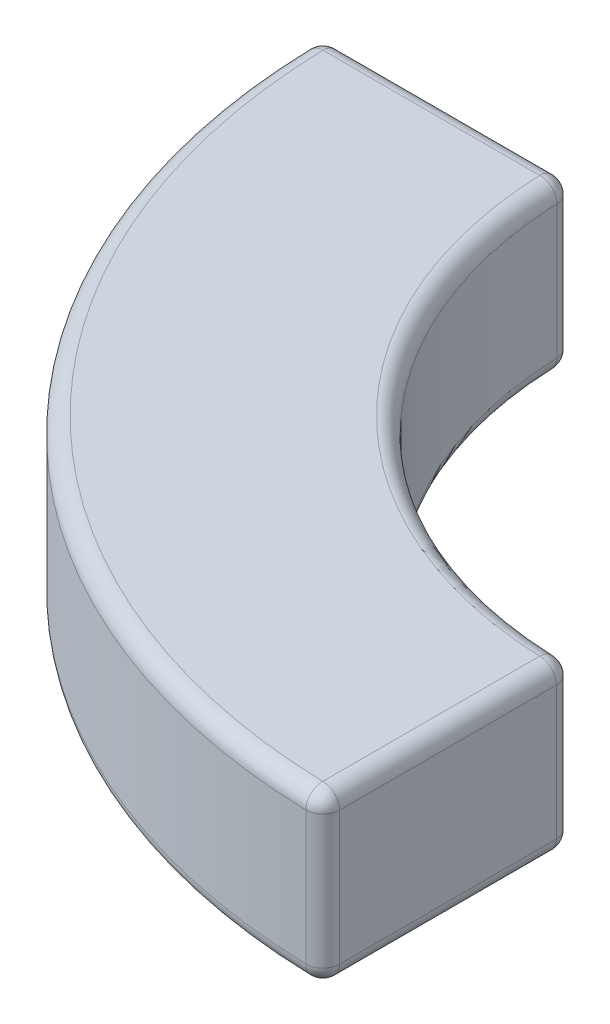
ISO-10303-21;
HEADER;
FILE_DESCRIPTION(('STEP AP214'),'2;1');
FILE_NAME('part.step','',(''),(''),'','','');
FILE_SCHEMA(('AUTOMOTIVE_DESIGN { 1 0 10303 214 1 1 1 1 }'));
ENDSEC;
DATA;
#1=APPLICATION_CONTEXT('core data for automotive mechanical design processes');
#2=APPLICATION_PROTOCOL_DEFINITION('international standard','automotive_design',2000,#1);
#3=PRODUCT_CONTEXT('',#1,'mechanical');
#4=PRODUCT('Part','Part','',(#3));
#5=PRODUCT_RELATED_PRODUCT_CATEGORY('part','',(#4));
#6=PRODUCT_DEFINITION_FORMATION('','',#4);
#7=PRODUCT_DEFINITION_CONTEXT('part definition',#1,'design');
#8=PRODUCT_DEFINITION('design','',#6,#7);
#9=PRODUCT_DEFINITION_SHAPE('','',#8);
#10=(LENGTH_UNIT() NAMED_UNIT(*) SI_UNIT(.MILLI.,.METRE.));
#11=(NAMED_UNIT(*) PLANE_ANGLE_UNIT() SI_UNIT($,.RADIAN.));
#12=(NAMED_UNIT(*) SI_UNIT($,.STERADIAN.) SOLID_ANGLE_UNIT());
#13=UNCERTAINTY_MEASURE_WITH_UNIT(LENGTH_MEASURE(1.E-05),#10,'distance_accuracy_value','');
#14=(GEOMETRIC_REPRESENTATION_CONTEXT(3) GLOBAL_UNCERTAINTY_ASSIGNED_CONTEXT((#13)) GLOBAL_UNIT_ASSIGNED_CONTEXT((#10,
#11,#12)) REPRESENTATION_CONTEXT('',''));
#15=CARTESIAN_POINT('',(0.,0.,0.));
#16=DIRECTION('',(0.,0.,1.));
#17=DIRECTION('',(1.,0.,0.));
#18=AXIS2_PLACEMENT_3D('',#15,#16,#17);
#19=CARTESIAN_POINT('',(0.,5.,0.));
#20=DIRECTION('',(0.,-1.,0.));
#21=DIRECTION('',(0.,0.,-1.));
#22=AXIS2_PLACEMENT_3D('',#19,#20,#21);
#23=CYLINDRICAL_SURFACE('',#22,12.5);
#24=DIRECTION('',(0.,-1.,0.));
#25=VECTOR('',#24,1.);
#26=CARTESIAN_POINT('',(-12.4907510161217,5.,0.480769230769231));
#27=LINE('',#26,#25);
#28=CARTESIAN_POINT('',(-12.4907510161217,0.5,0.480769230769231));
#29=VERTEX_POINT('',#28);
#30=CARTESIAN_POINT('',(-12.4907510161217,4.5,0.480769230769231));
#31=VERTEX_POINT('',#30);
#32=EDGE_CURVE('E137',#29,#31,#27,.F.);
#33=ORIENTED_EDGE('',*,*,#32,.T.);
#34=CARTESIAN_POINT('',(0.,4.5,0.));
#35=DIRECTION('',(0.,1.,0.));
#36=DIRECTION('',(0.,0.,1.));
#37=AXIS2_PLACEMENT_3D('',#34,#35,#36);
#38=CIRCLE('',#37,12.5);
#39=CARTESIAN_POINT('',(-0.480769230769229,4.5,12.4907510161217));
#40=VERTEX_POINT('',#39);
#41=EDGE_CURVE('E174',#31,#40,#38,.T.);
#42=ORIENTED_EDGE('',*,*,#41,.T.);
#43=DIRECTION('',(0.,-1.,0.));
#44=VECTOR('',#43,1.);
#45=CARTESIAN_POINT('',(-0.480769230769229,5.,12.4907510161217));
#46=LINE('',#45,#44);
#47=CARTESIAN_POINT('',(-0.480769230769229,0.5,12.4907510161217));
#48=VERTEX_POINT('',#47);
#49=EDGE_CURVE('E171',#40,#48,#46,.T.);
#50=ORIENTED_EDGE('',*,*,#49,.T.);
#51=CARTESIAN_POINT('',(0.,0.5,0.));
#52=DIRECTION('',(0.,1.,0.));
#53=DIRECTION('',(0.,0.,1.));
#54=AXIS2_PLACEMENT_3D('',#51,#52,#53);
#55=CIRCLE('',#54,12.5);
#56=EDGE_CURVE('E166',#48,#29,#55,.F.);
#57=ORIENTED_EDGE('',*,*,#56,.T.);
#58=EDGE_LOOP('',(#33,#42,#50,#57));
#59=FACE_BOUND('',#58,.T.);
#60=ADVANCED_FACE('F42',(#59),#23,.F.);
#61=CARTESIAN_POINT('',(-12.5,5.,0.));
#62=DIRECTION('',(0.,0.,1.));
#63=DIRECTION('',(1.,0.,0.));
#64=AXIS2_PLACEMENT_3D('',#61,#62,#63);
#65=PLANE('',#64);
#66=DIRECTION('',(0.,-1.,0.));
#67=VECTOR('',#66,1.);
#68=CARTESIAN_POINT('',(-19.4935886896179,5.,0.));
#69=LINE('',#68,#67);
#70=CARTESIAN_POINT('',(-19.4935886896179,0.5,0.));
#71=VERTEX_POINT('',#70);
#72=CARTESIAN_POINT('',(-19.4935886896179,4.5,0.));
#73=VERTEX_POINT('',#72);
#74=EDGE_CURVE('E159',#71,#73,#69,.F.);
#75=ORIENTED_EDGE('',*,*,#74,.T.);
#76=DIRECTION('',(-1.,0.,0.));
#77=VECTOR('',#76,1.);
#78=CARTESIAN_POINT('',(-12.5,4.5,0.));
#79=LINE('',#78,#77);
#80=CARTESIAN_POINT('',(-12.9903810567666,4.5,0.));
#81=VERTEX_POINT('',#80);
#82=EDGE_CURVE('E163',#73,#81,#79,.F.);
#83=ORIENTED_EDGE('',*,*,#82,.T.);
#84=DIRECTION('',(0.,-1.,0.));
#85=VECTOR('',#84,1.);
#86=CARTESIAN_POINT('',(-12.9903810567666,5.,0.));
#87=LINE('',#86,#85);
#88=CARTESIAN_POINT('',(-12.9903810567666,0.5,0.));
#89=VERTEX_POINT('',#88);
#90=EDGE_CURVE('E135',#81,#89,#87,.T.);
#91=ORIENTED_EDGE('',*,*,#90,.T.);
#92=DIRECTION('',(-1.,0.,0.));
#93=VECTOR('',#92,1.);
#94=CARTESIAN_POINT('',(-12.5,0.5,0.));
#95=LINE('',#94,#93);
#96=EDGE_CURVE('E153',#89,#71,#95,.T.);
#97=ORIENTED_EDGE('',*,*,#96,.T.);
#98=EDGE_LOOP('',(#75,#83,#91,#97));
#99=FACE_BOUND('',#98,.T.);
#100=ADVANCED_FACE('F161',(#99),#65,.F.);
#101=CARTESIAN_POINT('',(0.,5.,0.));
#102=DIRECTION('',(0.,-1.,0.));
#103=DIRECTION('',(0.,0.,-1.));
#104=AXIS2_PLACEMENT_3D('',#101,#102,#103);
#105=CYLINDRICAL_SURFACE('',#104,20.);
#106=DIRECTION('',(0.,-1.,0.));
#107=VECTOR('',#106,1.);
#108=CARTESIAN_POINT('',(-0.51282051282051,5.,19.993424297044));
#109=LINE('',#108,#107);
#110=CARTESIAN_POINT('',(-0.51282051282051,0.5,19.993424297044));
#111=VERTEX_POINT('',#110);
#112=CARTESIAN_POINT('',(-0.51282051282051,4.5,19.993424297044));
#113=VERTEX_POINT('',#112);
#114=EDGE_CURVE('E178',#111,#113,#109,.F.);
#115=ORIENTED_EDGE('',*,*,#114,.T.);
#116=CARTESIAN_POINT('',(0.,4.5,0.));
#117=DIRECTION('',(0.,1.,0.));
#118=DIRECTION('',(0.,0.,1.));
#119=AXIS2_PLACEMENT_3D('',#116,#117,#118);
#120=CIRCLE('',#119,20.);
#121=CARTESIAN_POINT('',(-19.993424297044,4.5,0.512820512820514));
#122=VERTEX_POINT('',#121);
#123=EDGE_CURVE('E183',#113,#122,#120,.F.);
#124=ORIENTED_EDGE('',*,*,#123,.T.);
#125=DIRECTION('',(0.,-1.,0.));
#126=VECTOR('',#125,1.);
#127=CARTESIAN_POINT('',(-19.993424297044,5.,0.512820512820514));
#128=LINE('',#127,#126);
#129=CARTESIAN_POINT('',(-19.993424297044,0.5,0.512820512820514));
#130=VERTEX_POINT('',#129);
#131=EDGE_CURVE('E180',#122,#130,#128,.T.);
#132=ORIENTED_EDGE('',*,*,#131,.T.);
#133=CARTESIAN_POINT('',(0.,0.5,0.));
#134=DIRECTION('',(0.,1.,0.));
#135=DIRECTION('',(0.,0.,1.));
#136=AXIS2_PLACEMENT_3D('',#133,#134,#135);
#137=CIRCLE('',#136,20.);
#138=EDGE_CURVE('E176',#130,#111,#137,.T.);
#139=ORIENTED_EDGE('',*,*,#138,.T.);
#140=EDGE_LOOP('',(#115,#124,#132,#139));
#141=FACE_BOUND('',#140,.T.);
#142=ADVANCED_FACE('F288',(#141),#105,.T.);
#143=CARTESIAN_POINT('',(0.,5.,12.5));
#144=DIRECTION('',(-1.,0.,0.));
#145=DIRECTION('',(0.,0.,1.));
#146=AXIS2_PLACEMENT_3D('',#143,#144,#145);
#147=PLANE('',#146);
#148=DIRECTION('',(0.,-1.,0.));
#149=VECTOR('',#148,1.);
#150=CARTESIAN_POINT('',(0.,5.,12.9903810567666));
#151=LINE('',#150,#149);
#152=CARTESIAN_POINT('',(0.,0.5,12.9903810567666));
#153=VERTEX_POINT('',#152);
#154=CARTESIAN_POINT('',(0.,4.5,12.9903810567666));
#155=VERTEX_POINT('',#154);
#156=EDGE_CURVE('E187',#153,#155,#151,.F.);
#157=ORIENTED_EDGE('',*,*,#156,.T.);
#158=DIRECTION('',(0.,0.,-1.));
#159=VECTOR('',#158,1.);
#160=CARTESIAN_POINT('',(0.,4.5,20.));
#161=LINE('',#160,#159);
#162=CARTESIAN_POINT('',(0.,4.5,19.4935886896179));
#163=VERTEX_POINT('',#162);
#164=EDGE_CURVE('E192',#155,#163,#161,.F.);
#165=ORIENTED_EDGE('',*,*,#164,.T.);
#166=DIRECTION('',(0.,-1.,0.));
#167=VECTOR('',#166,1.);
#168=CARTESIAN_POINT('',(0.,5.,19.4935886896179));
#169=LINE('',#168,#167);
#170=CARTESIAN_POINT('',(0.,0.5,19.4935886896179));
#171=VERTEX_POINT('',#170);
#172=EDGE_CURVE('E189',#163,#171,#169,.T.);
#173=ORIENTED_EDGE('',*,*,#172,.T.);
#174=DIRECTION('',(0.,0.,-1.));
#175=VECTOR('',#174,1.);
#176=CARTESIAN_POINT('',(0.,0.5,12.5));
#177=LINE('',#176,#175);
#178=EDGE_CURVE('E185',#171,#153,#177,.T.);
#179=ORIENTED_EDGE('',*,*,#178,.T.);
#180=EDGE_LOOP('',(#157,#165,#173,#179));
#181=FACE_BOUND('',#180,.T.);
#182=ADVANCED_FACE('F298',(#181),#147,.F.);
#183=CARTESIAN_POINT('',(0.,5.,0.));
#184=DIRECTION('',(0.,1.,0.));
#185=DIRECTION('',(0.,0.,1.));
#186=AXIS2_PLACEMENT_3D('',#183,#184,#185);
#187=PLANE('',#186);
#188=CARTESIAN_POINT('',(0.,5.,0.));
#189=DIRECTION('',(0.,1.,0.));
#190=DIRECTION('',(0.,0.,1.));
#191=AXIS2_PLACEMENT_3D('',#188,#189,#190);
#192=CIRCLE('',#191,19.5);
#193=CARTESIAN_POINT('',(-19.4935886896179,5.,0.500000000000001));
#194=VERTEX_POINT('',#193);
#195=CARTESIAN_POINT('',(-0.499999999999998,5.,19.4935886896179));
#196=VERTEX_POINT('',#195);
#197=EDGE_CURVE('E198',#194,#196,#192,.T.);
#198=ORIENTED_EDGE('',*,*,#197,.T.);
#199=DIRECTION('',(0.,0.,-1.));
#200=VECTOR('',#199,1.);
#201=CARTESIAN_POINT('',(-0.499999999999999,5.,12.5));
#202=LINE('',#201,#200);
#203=CARTESIAN_POINT('',(-0.499999999999998,5.,12.9903810567666));
#204=VERTEX_POINT('',#203);
#205=EDGE_CURVE('E200',#196,#204,#202,.T.);
#206=ORIENTED_EDGE('',*,*,#205,.T.);
#207=CARTESIAN_POINT('',(0.,5.,0.));
#208=DIRECTION('',(0.,1.,0.));
#209=DIRECTION('',(0.,0.,1.));
#210=AXIS2_PLACEMENT_3D('',#207,#208,#209);
#211=CIRCLE('',#210,13.);
#212=CARTESIAN_POINT('',(-12.9903810567666,5.,0.5));
#213=VERTEX_POINT('',#212);
#214=EDGE_CURVE('E194',#204,#213,#211,.F.);
#215=ORIENTED_EDGE('',*,*,#214,.T.);
#216=DIRECTION('',(-1.,0.,0.));
#217=VECTOR('',#216,1.);
#218=CARTESIAN_POINT('',(-20.,5.,0.500000000000001));
#219=LINE('',#218,#217);
#220=EDGE_CURVE('E196',#213,#194,#219,.T.);
#221=ORIENTED_EDGE('',*,*,#220,.T.);
#222=EDGE_LOOP('',(#198,#206,#215,#221));
#223=FACE_BOUND('',#222,.T.);
#224=ADVANCED_FACE('F280',(#223),#187,.T.);
#225=CARTESIAN_POINT('',(0.,0.,0.));
#226=DIRECTION('',(0.,1.,0.));
#227=DIRECTION('',(0.,0.,1.));
#228=AXIS2_PLACEMENT_3D('',#225,#226,#227);
#229=PLANE('',#228);
#230=CARTESIAN_POINT('',(0.,0.,0.));
#231=DIRECTION('',(0.,1.,0.));
#232=DIRECTION('',(0.,0.,1.));
#233=AXIS2_PLACEMENT_3D('',#230,#231,#232);
#234=CIRCLE('',#233,13.);
#235=CARTESIAN_POINT('',(-12.9903810567666,0.,0.5));
#236=VERTEX_POINT('',#235);
#237=CARTESIAN_POINT('',(-0.499999999999998,0.,12.9903810567666));
#238=VERTEX_POINT('',#237);
#239=EDGE_CURVE('E203',#236,#238,#234,.T.);
#240=ORIENTED_EDGE('',*,*,#239,.T.);
#241=DIRECTION('',(0.,0.,-1.));
#242=VECTOR('',#241,1.);
#243=CARTESIAN_POINT('',(-0.5,0.,0.));
#244=LINE('',#243,#242);
#245=CARTESIAN_POINT('',(-0.499999999999998,0.,19.4935886896179));
#246=VERTEX_POINT('',#245);
#247=EDGE_CURVE('E11',#238,#246,#244,.F.);
#248=ORIENTED_EDGE('',*,*,#247,.T.);
#249=CARTESIAN_POINT('',(0.,0.,0.));
#250=DIRECTION('',(0.,1.,0.));
#251=DIRECTION('',(0.,0.,1.));
#252=AXIS2_PLACEMENT_3D('',#249,#250,#251);
#253=CIRCLE('',#252,19.5);
#254=CARTESIAN_POINT('',(-19.4935886896179,0.,0.500000000000001));
#255=VERTEX_POINT('',#254);
#256=EDGE_CURVE('E51',#246,#255,#253,.F.);
#257=ORIENTED_EDGE('',*,*,#256,.T.);
#258=DIRECTION('',(-1.,0.,0.));
#259=VECTOR('',#258,1.);
#260=CARTESIAN_POINT('',(0.,0.,0.499999999999999));
#261=LINE('',#260,#259);
#262=EDGE_CURVE('E205',#255,#236,#261,.F.);
#263=ORIENTED_EDGE('',*,*,#262,.T.);
#264=EDGE_LOOP('',(#240,#248,#257,#263));
#265=FACE_BOUND('',#264,.T.);
#266=ADVANCED_FACE('F526',(#265),#229,.F.);
#267=CARTESIAN_POINT('',(-0.499999999999998,5.,19.4935886896179));
#268=DIRECTION('',(0.,-1.,0.));
#269=DIRECTION('',(0.,0.,-1.));
#270=AXIS2_PLACEMENT_3D('',#267,#268,#269);
#271=CYLINDRICAL_SURFACE('',#270,0.5);
#272=CARTESIAN_POINT('',(-0.499999999999998,4.5,19.4935886896179));
#273=DIRECTION('',(0.,1.,0.));
#274=DIRECTION('',(0.,0.,1.));
#275=AXIS2_PLACEMENT_3D('',#272,#273,#274);
#276=CIRCLE('',#275,0.5);
#277=EDGE_CURVE('E46',#113,#163,#276,.T.);
#278=ORIENTED_EDGE('',*,*,#277,.F.);
#279=ORIENTED_EDGE('',*,*,#114,.F.);
#280=CARTESIAN_POINT('',(-0.499999999999998,0.5,19.4935886896179));
#281=DIRECTION('',(0.,-1.,0.));
#282=DIRECTION('',(0.,0.,-1.));
#283=AXIS2_PLACEMENT_3D('',#280,#281,#282);
#284=CIRCLE('',#283,0.5);
#285=EDGE_CURVE('E258',#171,#111,#284,.T.);
#286=ORIENTED_EDGE('',*,*,#285,.F.);
#287=ORIENTED_EDGE('',*,*,#172,.F.);
#288=EDGE_LOOP('',(#278,#279,#286,#287));
#289=FACE_BOUND('',#288,.T.);
#290=ADVANCED_FACE('F44',(#289),#271,.T.);
#291=CARTESIAN_POINT('',(-0.499999999999998,4.5,19.4935886896179));
#292=DIRECTION('',(0.,1.,0.));
#293=DIRECTION('',(0.,0.,1.));
#294=AXIS2_PLACEMENT_3D('',#291,#292,#293);
#295=SPHERICAL_SURFACE('',#294,0.5);
#296=CARTESIAN_POINT('',(-0.499999999999998,4.5,19.4935886896179));
#297=DIRECTION('',(0.999671214852202,0.,0.0256410256410255));
#298=DIRECTION('',(0.0256410256410255,0.,-0.999671214852202));
#299=AXIS2_PLACEMENT_3D('',#296,#297,#298);
#300=CIRCLE('',#299,0.5);
#301=EDGE_CURVE('E253',#113,#196,#300,.F.);
#302=ORIENTED_EDGE('',*,*,#301,.F.);
#303=ORIENTED_EDGE('',*,*,#277,.T.);
#304=CARTESIAN_POINT('',(-0.499999999999998,4.5,19.4935886896179));
#305=DIRECTION('',(0.,0.,1.));
#306=DIRECTION('',(1.,0.,0.));
#307=AXIS2_PLACEMENT_3D('',#304,#305,#306);
#308=CIRCLE('',#307,0.5);
#309=EDGE_CURVE('E256',#196,#163,#308,.F.);
#310=ORIENTED_EDGE('',*,*,#309,.F.);
#311=EDGE_LOOP('',(#302,#303,#310));
#312=FACE_BOUND('',#311,.T.);
#313=ADVANCED_FACE('F268',(#312),#295,.T.);
#314=CARTESIAN_POINT('',(-0.499999999999998,0.5,19.4935886896179));
#315=DIRECTION('',(0.,-1.,0.));
#316=DIRECTION('',(0.,0.,-1.));
#317=AXIS2_PLACEMENT_3D('',#314,#315,#316);
#318=SPHERICAL_SURFACE('',#317,0.5);
#319=CARTESIAN_POINT('',(-0.499999999999998,0.5,19.4935886896179));
#320=DIRECTION('',(0.,0.,1.));
#321=DIRECTION('',(1.,0.,0.));
#322=AXIS2_PLACEMENT_3D('',#319,#320,#321);
#323=CIRCLE('',#322,0.5);
#324=EDGE_CURVE('E248',#171,#246,#323,.F.);
#325=ORIENTED_EDGE('',*,*,#324,.F.);
#326=ORIENTED_EDGE('',*,*,#285,.T.);
#327=CARTESIAN_POINT('',(-0.499999999999998,0.5,19.4935886896179));
#328=DIRECTION('',(0.999671214852202,0.,0.0256410256410257));
#329=DIRECTION('',(0.0256410256410257,0.,-0.999671214852202));
#330=AXIS2_PLACEMENT_3D('',#327,#328,#329);
#331=CIRCLE('',#330,0.5);
#332=EDGE_CURVE('E251',#246,#111,#331,.F.);
#333=ORIENTED_EDGE('',*,*,#332,.F.);
#334=EDGE_LOOP('',(#325,#326,#333));
#335=FACE_BOUND('',#334,.T.);
#336=ADVANCED_FACE('F499',(#335),#318,.T.);
#337=CARTESIAN_POINT('',(-0.5,4.5,0.));
#338=DIRECTION('',(0.,0.,1.));
#339=DIRECTION('',(1.,0.,0.));
#340=AXIS2_PLACEMENT_3D('',#337,#338,#339);
#341=CYLINDRICAL_SURFACE('',#340,0.5);
#342=ORIENTED_EDGE('',*,*,#309,.T.);
#343=ORIENTED_EDGE('',*,*,#164,.F.);
#344=CARTESIAN_POINT('',(-0.499999999999998,4.5,12.9903810567666));
#345=DIRECTION('',(0.,0.,-1.));
#346=DIRECTION('',(-1.,0.,0.));
#347=AXIS2_PLACEMENT_3D('',#344,#345,#346);
#348=CIRCLE('',#347,0.5);
#349=EDGE_CURVE('E242',#204,#155,#348,.T.);
#350=ORIENTED_EDGE('',*,*,#349,.F.);
#351=ORIENTED_EDGE('',*,*,#205,.F.);
#352=EDGE_LOOP('',(#342,#343,#350,#351));
#353=FACE_BOUND('',#352,.T.);
#354=ADVANCED_FACE('F276',(#353),#341,.T.);
#355=CARTESIAN_POINT('',(0.,4.5,0.));
#356=DIRECTION('',(0.,1.,0.));
#357=DIRECTION('',(0.,0.,1.));
#358=AXIS2_PLACEMENT_3D('',#355,#356,#357);
#359=TOROIDAL_SURFACE('',#358,19.5,0.5);
#360=ORIENTED_EDGE('',*,*,#301,.T.);
#361=ORIENTED_EDGE('',*,*,#197,.F.);
#362=CARTESIAN_POINT('',(-19.4935886896179,4.5,0.500000000000001));
#363=DIRECTION('',(-0.0256410256410257,0.,-0.999671214852202));
#364=DIRECTION('',(-0.999671214852202,0.,0.0256410256410257));
#365=AXIS2_PLACEMENT_3D('',#362,#363,#364);
#366=CIRCLE('',#365,0.5);
#367=EDGE_CURVE('E239',#122,#194,#366,.T.);
#368=ORIENTED_EDGE('',*,*,#367,.F.);
#369=ORIENTED_EDGE('',*,*,#123,.F.);
#370=EDGE_LOOP('',(#360,#361,#368,#369));
#371=FACE_BOUND('',#370,.T.);
#372=ADVANCED_FACE('F285',(#371),#359,.T.);
#373=CARTESIAN_POINT('',(-19.4935886896179,5.,0.500000000000001));
#374=DIRECTION('',(0.,-1.,0.));
#375=DIRECTION('',(0.,0.,-1.));
#376=AXIS2_PLACEMENT_3D('',#373,#374,#375);
#377=CYLINDRICAL_SURFACE('',#376,0.5);
#378=CARTESIAN_POINT('',(-19.4935886896179,0.5,0.500000000000001));
#379=DIRECTION('',(0.,-1.,0.));
#380=DIRECTION('',(0.,0.,-1.));
#381=AXIS2_PLACEMENT_3D('',#378,#379,#380);
#382=CIRCLE('',#381,0.5);
#383=EDGE_CURVE('E233',#130,#71,#382,.T.);
#384=ORIENTED_EDGE('',*,*,#383,.F.);
#385=ORIENTED_EDGE('',*,*,#131,.F.);
#386=CARTESIAN_POINT('',(-19.4935886896179,4.5,0.500000000000001));
#387=DIRECTION('',(0.,1.,0.));
#388=DIRECTION('',(0.,0.,1.));
#389=AXIS2_PLACEMENT_3D('',#386,#387,#388);
#390=CIRCLE('',#389,0.5);
#391=EDGE_CURVE('E236',#73,#122,#390,.T.);
#392=ORIENTED_EDGE('',*,*,#391,.F.);
#393=ORIENTED_EDGE('',*,*,#74,.F.);
#394=EDGE_LOOP('',(#384,#385,#392,#393));
#395=FACE_BOUND('',#394,.T.);
#396=ADVANCED_FACE('F292',(#395),#377,.T.);
#397=CARTESIAN_POINT('',(0.,0.5,0.));
#398=DIRECTION('',(0.,1.,0.));
#399=DIRECTION('',(0.,0.,1.));
#400=AXIS2_PLACEMENT_3D('',#397,#398,#399);
#401=TOROIDAL_SURFACE('',#400,19.5,0.5);
#402=ORIENTED_EDGE('',*,*,#332,.T.);
#403=ORIENTED_EDGE('',*,*,#138,.F.);
#404=CARTESIAN_POINT('',(-19.4935886896179,0.5,0.500000000000001));
#405=DIRECTION('',(-0.0256410256410259,0.,-0.999671214852201));
#406=DIRECTION('',(-0.999671214852201,0.,0.0256410256410259));
#407=AXIS2_PLACEMENT_3D('',#404,#405,#406);
#408=CIRCLE('',#407,0.5);
#409=EDGE_CURVE('E231',#255,#130,#408,.T.);
#410=ORIENTED_EDGE('',*,*,#409,.F.);
#411=ORIENTED_EDGE('',*,*,#256,.F.);
#412=EDGE_LOOP('',(#402,#403,#410,#411));
#413=FACE_BOUND('',#412,.T.);
#414=ADVANCED_FACE('F296',(#413),#401,.T.);
#415=CARTESIAN_POINT('',(-0.499999999999999,0.5,12.5));
#416=DIRECTION('',(0.,0.,-1.));
#417=DIRECTION('',(-1.,0.,0.));
#418=AXIS2_PLACEMENT_3D('',#415,#416,#417);
#419=CYLINDRICAL_SURFACE('',#418,0.5);
#420=ORIENTED_EDGE('',*,*,#324,.T.);
#421=ORIENTED_EDGE('',*,*,#247,.F.);
#422=CARTESIAN_POINT('',(-0.499999999999998,0.5,12.9903810567666));
#423=DIRECTION('',(0.,0.,-1.));
#424=DIRECTION('',(0.,1.,0.));
#425=AXIS2_PLACEMENT_3D('',#422,#423,#424);
#426=CIRCLE('',#425,0.5);
#427=EDGE_CURVE('E228',#153,#238,#426,.T.);
#428=ORIENTED_EDGE('',*,*,#427,.F.);
#429=ORIENTED_EDGE('',*,*,#178,.F.);
#430=EDGE_LOOP('',(#420,#421,#428,#429));
#431=FACE_BOUND('',#430,.T.);
#432=ADVANCED_FACE('F308',(#431),#419,.T.);
#433=CARTESIAN_POINT('',(-0.499999999999998,5.,12.9903810567666));
#434=DIRECTION('',(0.,-1.,0.));
#435=DIRECTION('',(0.,0.,-1.));
#436=AXIS2_PLACEMENT_3D('',#433,#434,#435);
#437=CYLINDRICAL_SURFACE('',#436,0.5);
#438=CARTESIAN_POINT('',(-0.499999999999998,4.5,12.9903810567666));
#439=DIRECTION('',(0.,1.,0.));
#440=DIRECTION('',(0.,0.,1.));
#441=AXIS2_PLACEMENT_3D('',#438,#439,#440);
#442=CIRCLE('',#441,0.5);
#443=EDGE_CURVE('E245',#155,#40,#442,.T.);
#444=ORIENTED_EDGE('',*,*,#443,.F.);
#445=ORIENTED_EDGE('',*,*,#156,.F.);
#446=CARTESIAN_POINT('',(-0.499999999999998,0.5,12.9903810567666));
#447=DIRECTION('',(0.,-1.,0.));
#448=DIRECTION('',(0.,0.,-1.));
#449=AXIS2_PLACEMENT_3D('',#446,#447,#448);
#450=CIRCLE('',#449,0.5);
#451=EDGE_CURVE('E225',#48,#153,#450,.T.);
#452=ORIENTED_EDGE('',*,*,#451,.F.);
#453=ORIENTED_EDGE('',*,*,#49,.F.);
#454=EDGE_LOOP('',(#444,#445,#452,#453));
#455=FACE_BOUND('',#454,.T.);
#456=ADVANCED_FACE('F303',(#455),#437,.T.);
#457=CARTESIAN_POINT('',(-0.499999999999998,4.5,12.9903810567666));
#458=DIRECTION('',(0.,1.,0.));
#459=DIRECTION('',(0.,0.,1.));
#460=AXIS2_PLACEMENT_3D('',#457,#458,#459);
#461=SPHERICAL_SURFACE('',#460,0.5);
#462=ORIENTED_EDGE('',*,*,#349,.T.);
#463=ORIENTED_EDGE('',*,*,#443,.T.);
#464=CARTESIAN_POINT('',(-0.499999999999998,4.5,12.9903810567666));
#465=DIRECTION('',(0.999260081289737,0.,0.0384615384615384));
#466=DIRECTION('',(0.0384615384615384,0.,-0.999260081289737));
#467=AXIS2_PLACEMENT_3D('',#464,#465,#466);
#468=CIRCLE('',#467,0.5);
#469=EDGE_CURVE('E222',#204,#40,#468,.F.);
#470=ORIENTED_EDGE('',*,*,#469,.F.);
#471=EDGE_LOOP('',(#462,#463,#470));
#472=FACE_BOUND('',#471,.T.);
#473=ADVANCED_FACE('F319',(#472),#461,.T.);
#474=CARTESIAN_POINT('',(-19.4935886896179,4.5,0.500000000000001));
#475=DIRECTION('',(0.,1.,0.));
#476=DIRECTION('',(0.,0.,1.));
#477=AXIS2_PLACEMENT_3D('',#474,#475,#476);
#478=SPHERICAL_SURFACE('',#477,0.5);
#479=ORIENTED_EDGE('',*,*,#391,.T.);
#480=ORIENTED_EDGE('',*,*,#367,.T.);
#481=CARTESIAN_POINT('',(-19.4935886896179,4.5,0.500000000000001));
#482=DIRECTION('',(-1.,0.,0.));
#483=DIRECTION('',(0.,0.,1.));
#484=AXIS2_PLACEMENT_3D('',#481,#482,#483);
#485=CIRCLE('',#484,0.5);
#486=EDGE_CURVE('E219',#73,#194,#485,.F.);
#487=ORIENTED_EDGE('',*,*,#486,.F.);
#488=EDGE_LOOP('',(#479,#480,#487));
#489=FACE_BOUND('',#488,.T.);
#490=ADVANCED_FACE('F329',(#489),#478,.T.);
#491=CARTESIAN_POINT('',(-19.4935886896179,0.5,0.500000000000001));
#492=DIRECTION('',(0.,-1.,0.));
#493=DIRECTION('',(0.,0.,-1.));
#494=AXIS2_PLACEMENT_3D('',#491,#492,#493);
#495=SPHERICAL_SURFACE('',#494,0.5);
#496=ORIENTED_EDGE('',*,*,#409,.T.);
#497=ORIENTED_EDGE('',*,*,#383,.T.);
#498=CARTESIAN_POINT('',(-19.4935886896179,0.5,0.500000000000001));
#499=DIRECTION('',(-1.,0.,0.));
#500=DIRECTION('',(0.,0.,1.));
#501=AXIS2_PLACEMENT_3D('',#498,#499,#500);
#502=CIRCLE('',#501,0.5);
#503=EDGE_CURVE('E156',#255,#71,#502,.F.);
#504=ORIENTED_EDGE('',*,*,#503,.F.);
#505=EDGE_LOOP('',(#496,#497,#504));
#506=FACE_BOUND('',#505,.T.);
#507=ADVANCED_FACE('F331',(#506),#495,.T.);
#508=CARTESIAN_POINT('',(-0.499999999999998,0.5,12.9903810567666));
#509=DIRECTION('',(0.,-1.,0.));
#510=DIRECTION('',(0.,0.,-1.));
#511=AXIS2_PLACEMENT_3D('',#508,#509,#510);
#512=SPHERICAL_SURFACE('',#511,0.5);
#513=ORIENTED_EDGE('',*,*,#451,.T.);
#514=ORIENTED_EDGE('',*,*,#427,.T.);
#515=CARTESIAN_POINT('',(-0.499999999999998,0.5,12.9903810567666));
#516=DIRECTION('',(0.999260081289737,0.,0.0384615384615384));
#517=DIRECTION('',(0.0384615384615384,0.,-0.999260081289737));
#518=AXIS2_PLACEMENT_3D('',#515,#516,#517);
#519=CIRCLE('',#518,0.5);
#520=EDGE_CURVE('E215',#48,#238,#519,.F.);
#521=ORIENTED_EDGE('',*,*,#520,.F.);
#522=EDGE_LOOP('',(#513,#514,#521));
#523=FACE_BOUND('',#522,.T.);
#524=ADVANCED_FACE('F310',(#523),#512,.T.);
#525=CARTESIAN_POINT('',(0.,4.5,0.));
#526=DIRECTION('',(0.,1.,0.));
#527=DIRECTION('',(0.,0.,1.));
#528=AXIS2_PLACEMENT_3D('',#525,#526,#527);
#529=TOROIDAL_SURFACE('',#528,13.,0.5);
#530=ORIENTED_EDGE('',*,*,#469,.T.);
#531=ORIENTED_EDGE('',*,*,#41,.F.);
#532=CARTESIAN_POINT('',(-12.9903810567666,4.5,0.5));
#533=DIRECTION('',(-0.0384615384615385,0.,-0.999260081289737));
#534=DIRECTION('',(-0.999260081289737,0.,0.0384615384615385));
#535=AXIS2_PLACEMENT_3D('',#532,#533,#534);
#536=CIRCLE('',#535,0.5);
#537=EDGE_CURVE('E212',#213,#31,#536,.T.);
#538=ORIENTED_EDGE('',*,*,#537,.F.);
#539=ORIENTED_EDGE('',*,*,#214,.F.);
#540=EDGE_LOOP('',(#530,#531,#538,#539));
#541=FACE_BOUND('',#540,.T.);
#542=ADVANCED_FACE('F321',(#541),#529,.T.);
#543=CARTESIAN_POINT('',(0.,4.5,0.499999999999999));
#544=DIRECTION('',(1.,0.,0.));
#545=DIRECTION('',(0.,0.,-1.));
#546=AXIS2_PLACEMENT_3D('',#543,#544,#545);
#547=CYLINDRICAL_SURFACE('',#546,0.5);
#548=ORIENTED_EDGE('',*,*,#486,.T.);
#549=ORIENTED_EDGE('',*,*,#220,.F.);
#550=CARTESIAN_POINT('',(-12.9903810567666,4.5,0.5));
#551=DIRECTION('',(1.,0.,0.));
#552=DIRECTION('',(0.,1.,0.));
#553=AXIS2_PLACEMENT_3D('',#550,#551,#552);
#554=CIRCLE('',#553,0.5);
#555=EDGE_CURVE('E150',#81,#213,#554,.T.);
#556=ORIENTED_EDGE('',*,*,#555,.F.);
#557=ORIENTED_EDGE('',*,*,#82,.F.);
#558=EDGE_LOOP('',(#548,#549,#556,#557));
#559=FACE_BOUND('',#558,.T.);
#560=ADVANCED_FACE('F327',(#559),#547,.T.);
#561=CARTESIAN_POINT('',(-12.5,0.5,0.5));
#562=DIRECTION('',(-1.,0.,0.));
#563=DIRECTION('',(0.,0.,1.));
#564=AXIS2_PLACEMENT_3D('',#561,#562,#563);
#565=CYLINDRICAL_SURFACE('',#564,0.5);
#566=ORIENTED_EDGE('',*,*,#503,.T.);
#567=ORIENTED_EDGE('',*,*,#96,.F.);
#568=CARTESIAN_POINT('',(-12.9903810567666,0.5,0.5));
#569=DIRECTION('',(1.,0.,0.));
#570=DIRECTION('',(0.,0.,-1.));
#571=AXIS2_PLACEMENT_3D('',#568,#569,#570);
#572=CIRCLE('',#571,0.5);
#573=EDGE_CURVE('E143',#236,#89,#572,.T.);
#574=ORIENTED_EDGE('',*,*,#573,.F.);
#575=ORIENTED_EDGE('',*,*,#262,.F.);
#576=EDGE_LOOP('',(#566,#567,#574,#575));
#577=FACE_BOUND('',#576,.T.);
#578=ADVANCED_FACE('F154',(#577),#565,.T.);
#579=CARTESIAN_POINT('',(0.,0.5,0.));
#580=DIRECTION('',(0.,1.,0.));
#581=DIRECTION('',(0.,0.,1.));
#582=AXIS2_PLACEMENT_3D('',#579,#580,#581);
#583=TOROIDAL_SURFACE('',#582,13.,0.5);
#584=ORIENTED_EDGE('',*,*,#520,.T.);
#585=ORIENTED_EDGE('',*,*,#239,.F.);
#586=CARTESIAN_POINT('',(-12.9903810567666,0.5,0.5));
#587=DIRECTION('',(-0.0384615384615385,0.,-0.999260081289737));
#588=DIRECTION('',(-0.999260081289737,0.,0.0384615384615385));
#589=AXIS2_PLACEMENT_3D('',#586,#587,#588);
#590=CIRCLE('',#589,0.5);
#591=EDGE_CURVE('E147',#29,#236,#590,.T.);
#592=ORIENTED_EDGE('',*,*,#591,.F.);
#593=ORIENTED_EDGE('',*,*,#56,.F.);
#594=EDGE_LOOP('',(#584,#585,#592,#593));
#595=FACE_BOUND('',#594,.T.);
#596=ADVANCED_FACE('F314',(#595),#583,.T.);
#597=CARTESIAN_POINT('',(-12.9903810567666,4.5,0.5));
#598=DIRECTION('',(0.,1.,0.));
#599=DIRECTION('',(0.,0.,1.));
#600=AXIS2_PLACEMENT_3D('',#597,#598,#599);
#601=SPHERICAL_SURFACE('',#600,0.5);
#602=ORIENTED_EDGE('',*,*,#555,.T.);
#603=ORIENTED_EDGE('',*,*,#537,.T.);
#604=CARTESIAN_POINT('',(-12.9903810567666,4.5,0.5));
#605=DIRECTION('',(0.,1.,0.));
#606=DIRECTION('',(0.,0.,1.));
#607=AXIS2_PLACEMENT_3D('',#604,#605,#606);
#608=CIRCLE('',#607,0.5);
#609=EDGE_CURVE('E140',#81,#31,#608,.F.);
#610=ORIENTED_EDGE('',*,*,#609,.F.);
#611=EDGE_LOOP('',(#602,#603,#610));
#612=FACE_BOUND('',#611,.T.);
#613=ADVANCED_FACE('F325',(#612),#601,.T.);
#614=CARTESIAN_POINT('',(-12.9903810567666,0.5,0.5));
#615=DIRECTION('',(0.,-1.,0.));
#616=DIRECTION('',(0.,0.,-1.));
#617=AXIS2_PLACEMENT_3D('',#614,#615,#616);
#618=SPHERICAL_SURFACE('',#617,0.5);
#619=ORIENTED_EDGE('',*,*,#591,.T.);
#620=ORIENTED_EDGE('',*,*,#573,.T.);
#621=CARTESIAN_POINT('',(-12.9903810567666,0.5,0.5));
#622=DIRECTION('',(0.,-1.,0.));
#623=DIRECTION('',(0.,0.,-1.));
#624=AXIS2_PLACEMENT_3D('',#621,#622,#623);
#625=CIRCLE('',#624,0.5);
#626=EDGE_CURVE('E131',#29,#89,#625,.F.);
#627=ORIENTED_EDGE('',*,*,#626,.F.);
#628=EDGE_LOOP('',(#619,#620,#627));
#629=FACE_BOUND('',#628,.T.);
#630=ADVANCED_FACE('F145',(#629),#618,.T.);
#631=CARTESIAN_POINT('',(-12.9903810567666,5.,0.5));
#632=DIRECTION('',(0.,-1.,0.));
#633=DIRECTION('',(0.,0.,-1.));
#634=AXIS2_PLACEMENT_3D('',#631,#632,#633);
#635=CYLINDRICAL_SURFACE('',#634,0.5);
#636=ORIENTED_EDGE('',*,*,#609,.T.);
#637=ORIENTED_EDGE('',*,*,#32,.F.);
#638=ORIENTED_EDGE('',*,*,#626,.T.);
#639=ORIENTED_EDGE('',*,*,#90,.F.);
#640=EDGE_LOOP('',(#636,#637,#638,#639));
#641=FACE_BOUND('',#640,.T.);
#642=ADVANCED_FACE('F133',(#641),#635,.T.);
#643=CLOSED_SHELL('',(#60,#100,#142,#182,#224,#266,#290,#313,#336,#354,#372,#396,#414,#432,#456,
#473,#490,#507,#524,#542,#560,#578,#596,#613,#630,#642));
#644=MANIFOLD_SOLID_BREP('B2',#643);
#645=ADVANCED_BREP_SHAPE_REPRESENTATION('',(#18,#644),#14);
#646=SHAPE_DEFINITION_REPRESENTATION(#9,#645);
ENDSEC;
END-ISO-10303-21;
